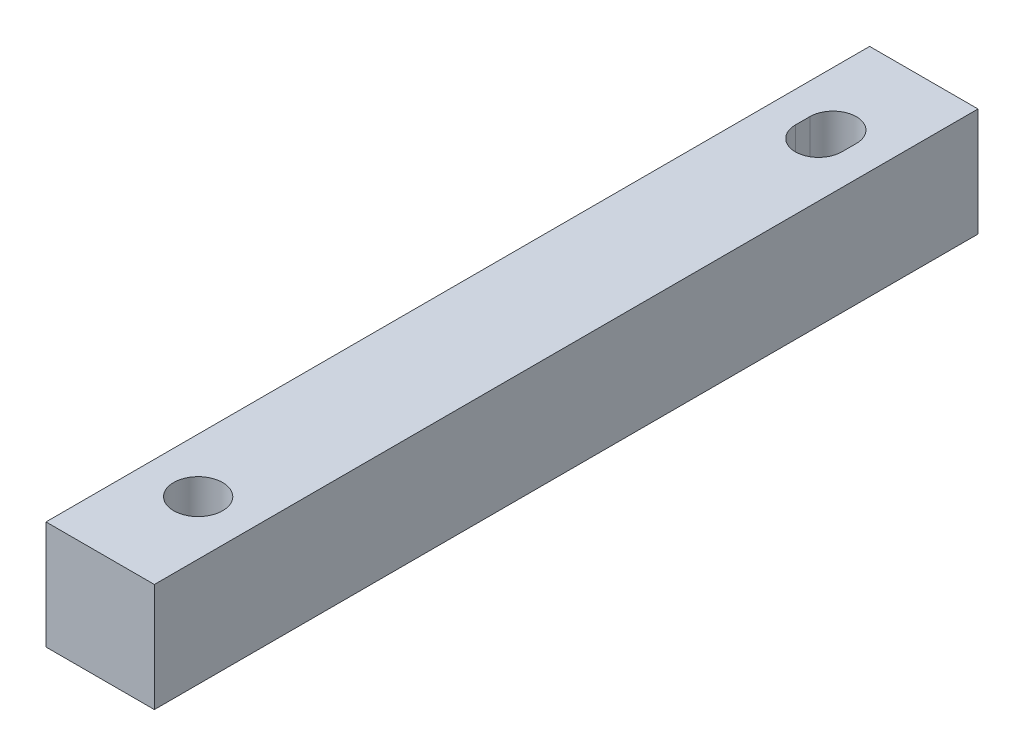
ISO-10303-21;
HEADER;
FILE_DESCRIPTION(('STEP AP214'),'2;1');
FILE_NAME('part.step','',(''),(''),'','','');
FILE_SCHEMA(('AUTOMOTIVE_DESIGN { 1 0 10303 214 1 1 1 1 }'));
ENDSEC;
DATA;
#1=APPLICATION_CONTEXT('core data for automotive mechanical design processes');
#2=APPLICATION_PROTOCOL_DEFINITION('international standard','automotive_design',2000,#1);
#3=PRODUCT_CONTEXT('',#1,'mechanical');
#4=PRODUCT('Part','Part','',(#3));
#5=PRODUCT_RELATED_PRODUCT_CATEGORY('part','',(#4));
#6=PRODUCT_DEFINITION_FORMATION('','',#4);
#7=PRODUCT_DEFINITION_CONTEXT('part definition',#1,'design');
#8=PRODUCT_DEFINITION('design','',#6,#7);
#9=PRODUCT_DEFINITION_SHAPE('','',#8);
#10=(LENGTH_UNIT() NAMED_UNIT(*) SI_UNIT(.MILLI.,.METRE.));
#11=(NAMED_UNIT(*) PLANE_ANGLE_UNIT() SI_UNIT($,.RADIAN.));
#12=(NAMED_UNIT(*) SI_UNIT($,.STERADIAN.) SOLID_ANGLE_UNIT());
#13=UNCERTAINTY_MEASURE_WITH_UNIT(LENGTH_MEASURE(1.E-05),#10,'distance_accuracy_value','');
#14=(GEOMETRIC_REPRESENTATION_CONTEXT(3) GLOBAL_UNCERTAINTY_ASSIGNED_CONTEXT((#13)) GLOBAL_UNIT_ASSIGNED_CONTEXT((#10,
#11,#12)) REPRESENTATION_CONTEXT('',''));
#15=CARTESIAN_POINT('',(0.,0.,0.));
#16=DIRECTION('',(0.,0.,1.));
#17=DIRECTION('',(1.,0.,0.));
#18=AXIS2_PLACEMENT_3D('',#15,#16,#17);
#19=CARTESIAN_POINT('',(-25.7385806955994,9.525,52.5567564118521));
#20=DIRECTION('',(1.,0.,0.));
#21=DIRECTION('',(0.,0.,-1.));
#22=AXIS2_PLACEMENT_3D('',#19,#20,#21);
#23=PLANE('',#22);
#24=DIRECTION('',(0.,0.,1.));
#25=VECTOR('',#24,1.);
#26=CARTESIAN_POINT('',(-25.7385806955994,0.,52.5567564118521));
#27=LINE('',#26,#25);
#28=CARTESIAN_POINT('',(-25.7385806955994,0.,-19.8332435881479));
#29=VERTEX_POINT('',#28);
#30=CARTESIAN_POINT('',(-25.7385806955994,0.,52.5567564118521));
#31=VERTEX_POINT('',#30);
#32=EDGE_CURVE('E144',#29,#31,#27,.T.);
#33=ORIENTED_EDGE('',*,*,#32,.T.);
#34=DIRECTION('',(0.,-1.,0.));
#35=VECTOR('',#34,1.);
#36=CARTESIAN_POINT('',(-25.7385806955994,9.525,52.5567564118521));
#37=LINE('',#36,#35);
#38=CARTESIAN_POINT('',(-25.7385806955994,9.525,52.5567564118521));
#39=VERTEX_POINT('',#38);
#40=EDGE_CURVE('E11',#39,#31,#37,.T.);
#41=ORIENTED_EDGE('',*,*,#40,.F.);
#42=DIRECTION('',(0.,0.,1.));
#43=VECTOR('',#42,1.);
#44=CARTESIAN_POINT('',(-25.7385806955994,9.525,52.5567564118521));
#45=LINE('',#44,#43);
#46=CARTESIAN_POINT('',(-25.7385806955994,9.525,-19.8332435881479));
#47=VERTEX_POINT('',#46);
#48=EDGE_CURVE('E133',#47,#39,#45,.T.);
#49=ORIENTED_EDGE('',*,*,#48,.F.);
#50=DIRECTION('',(0.,-1.,0.));
#51=VECTOR('',#50,1.);
#52=CARTESIAN_POINT('',(-25.7385806955994,9.525,-19.8332435881479));
#53=LINE('',#52,#51);
#54=EDGE_CURVE('E143',#47,#29,#53,.T.);
#55=ORIENTED_EDGE('',*,*,#54,.T.);
#56=EDGE_LOOP('',(#33,#41,#49,#55));
#57=FACE_BOUND('',#56,.T.);
#58=ADVANCED_FACE('F31',(#57),#23,.F.);
#59=CARTESIAN_POINT('',(-25.7385806955994,9.525,52.5567564118521));
#60=DIRECTION('',(0.,0.,-1.));
#61=DIRECTION('',(-1.,0.,0.));
#62=AXIS2_PLACEMENT_3D('',#59,#60,#61);
#63=PLANE('',#62);
#64=DIRECTION('',(1.,0.,0.));
#65=VECTOR('',#64,1.);
#66=CARTESIAN_POINT('',(-25.7385806955994,0.,52.5567564118521));
#67=LINE('',#66,#65);
#68=CARTESIAN_POINT('',(-16.2135806955994,0.,52.5567564118521));
#69=VERTEX_POINT('',#68);
#70=EDGE_CURVE('E147',#31,#69,#67,.T.);
#71=ORIENTED_EDGE('',*,*,#70,.T.);
#72=DIRECTION('',(0.,-1.,0.));
#73=VECTOR('',#72,1.);
#74=CARTESIAN_POINT('',(-16.2135806955994,9.525,52.5567564118521));
#75=LINE('',#74,#73);
#76=CARTESIAN_POINT('',(-16.2135806955994,9.525,52.5567564118521));
#77=VERTEX_POINT('',#76);
#78=EDGE_CURVE('E39',#77,#69,#75,.T.);
#79=ORIENTED_EDGE('',*,*,#78,.F.);
#80=DIRECTION('',(1.,0.,0.));
#81=VECTOR('',#80,1.);
#82=CARTESIAN_POINT('',(-25.7385806955994,9.525,52.5567564118521));
#83=LINE('',#82,#81);
#84=EDGE_CURVE('E136',#39,#77,#83,.T.);
#85=ORIENTED_EDGE('',*,*,#84,.F.);
#86=ORIENTED_EDGE('',*,*,#40,.T.);
#87=EDGE_LOOP('',(#71,#79,#85,#86));
#88=FACE_BOUND('',#87,.T.);
#89=ADVANCED_FACE('F177',(#88),#63,.F.);
#90=CARTESIAN_POINT('',(-16.2135806955994,9.525,52.5567564118521));
#91=DIRECTION('',(-1.,0.,0.));
#92=DIRECTION('',(0.,0.,1.));
#93=AXIS2_PLACEMENT_3D('',#90,#91,#92);
#94=PLANE('',#93);
#95=DIRECTION('',(0.,0.,-1.));
#96=VECTOR('',#95,1.);
#97=CARTESIAN_POINT('',(-16.2135806955994,0.,52.5567564118521));
#98=LINE('',#97,#96);
#99=CARTESIAN_POINT('',(-16.2135806955994,0.,-19.8332435881479));
#100=VERTEX_POINT('',#99);
#101=EDGE_CURVE('E149',#69,#100,#98,.T.);
#102=ORIENTED_EDGE('',*,*,#101,.T.);
#103=DIRECTION('',(0.,-1.,0.));
#104=VECTOR('',#103,1.);
#105=CARTESIAN_POINT('',(-16.2135806955994,9.525,-19.8332435881479));
#106=LINE('',#105,#104);
#107=CARTESIAN_POINT('',(-16.2135806955994,9.525,-19.8332435881479));
#108=VERTEX_POINT('',#107);
#109=EDGE_CURVE('E154',#108,#100,#106,.T.);
#110=ORIENTED_EDGE('',*,*,#109,.F.);
#111=DIRECTION('',(0.,0.,-1.));
#112=VECTOR('',#111,1.);
#113=CARTESIAN_POINT('',(-16.2135806955994,9.525,52.5567564118521));
#114=LINE('',#113,#112);
#115=EDGE_CURVE('E139',#77,#108,#114,.T.);
#116=ORIENTED_EDGE('',*,*,#115,.F.);
#117=ORIENTED_EDGE('',*,*,#78,.T.);
#118=EDGE_LOOP('',(#102,#110,#116,#117));
#119=FACE_BOUND('',#118,.T.);
#120=ADVANCED_FACE('F162',(#119),#94,.F.);
#121=CARTESIAN_POINT('',(-25.7385806955994,9.525,-19.8332435881479));
#122=DIRECTION('',(0.,0.,1.));
#123=DIRECTION('',(1.,0.,0.));
#124=AXIS2_PLACEMENT_3D('',#121,#122,#123);
#125=PLANE('',#124);
#126=DIRECTION('',(-1.,0.,0.));
#127=VECTOR('',#126,1.);
#128=CARTESIAN_POINT('',(-25.7385806955994,0.,-19.8332435881479));
#129=LINE('',#128,#127);
#130=EDGE_CURVE('E137',#100,#29,#129,.T.);
#131=ORIENTED_EDGE('',*,*,#130,.T.);
#132=ORIENTED_EDGE('',*,*,#54,.F.);
#133=DIRECTION('',(-1.,0.,0.));
#134=VECTOR('',#133,1.);
#135=CARTESIAN_POINT('',(-25.7385806955994,9.525,-19.8332435881479));
#136=LINE('',#135,#134);
#137=EDGE_CURVE('E141',#108,#47,#136,.T.);
#138=ORIENTED_EDGE('',*,*,#137,.F.);
#139=ORIENTED_EDGE('',*,*,#109,.T.);
#140=EDGE_LOOP('',(#131,#132,#138,#139));
#141=FACE_BOUND('',#140,.T.);
#142=ADVANCED_FACE('F170',(#141),#125,.F.);
#143=CARTESIAN_POINT('',(-25.7385806955994,9.525,-19.8332435881479));
#144=DIRECTION('',(0.,-1.,0.));
#145=DIRECTION('',(0.,0.,-1.));
#146=AXIS2_PLACEMENT_3D('',#143,#144,#145);
#147=PLANE('',#146);
#148=DIRECTION('',(0.,0.,1.));
#149=VECTOR('',#148,1.);
#150=CARTESIAN_POINT('',(-23.0214832911406,9.525,-11.8560560881479));
#151=LINE('',#150,#149);
#152=CARTESIAN_POINT('',(-23.0214832911406,9.525,-11.8560560881479));
#153=VERTEX_POINT('',#152);
#154=CARTESIAN_POINT('',(-23.0214832911406,9.525,-10.5860560881479));
#155=VERTEX_POINT('',#154);
#156=EDGE_CURVE('E115',#153,#155,#151,.T.);
#157=ORIENTED_EDGE('',*,*,#156,.F.);
#158=CARTESIAN_POINT('',(-20.9760806955994,9.525,-11.8560560881479));
#159=DIRECTION('',(0.,1.,0.));
#160=DIRECTION('',(0.,0.,1.));
#161=AXIS2_PLACEMENT_3D('',#158,#159,#160);
#162=CIRCLE('',#161,2.04540259554119);
#163=CARTESIAN_POINT('',(-18.9306781000582,9.525,-11.8560560881479));
#164=VERTEX_POINT('',#163);
#165=EDGE_CURVE('E46',#164,#153,#162,.T.);
#166=ORIENTED_EDGE('',*,*,#165,.F.);
#167=DIRECTION('',(0.,0.,-1.));
#168=VECTOR('',#167,1.);
#169=CARTESIAN_POINT('',(-18.9306781000582,9.525,-11.8560560881479));
#170=LINE('',#169,#168);
#171=CARTESIAN_POINT('',(-18.9306781000582,9.525,-10.5860560881479));
#172=VERTEX_POINT('',#171);
#173=EDGE_CURVE('E108',#172,#164,#170,.T.);
#174=ORIENTED_EDGE('',*,*,#173,.F.);
#175=CARTESIAN_POINT('',(-20.9760806955994,9.525,-10.5860560881479));
#176=DIRECTION('',(0.,1.,0.));
#177=DIRECTION('',(0.,0.,1.));
#178=AXIS2_PLACEMENT_3D('',#175,#176,#177);
#179=CIRCLE('',#178,2.04540259554119);
#180=EDGE_CURVE('E122',#155,#172,#179,.T.);
#181=ORIENTED_EDGE('',*,*,#180,.F.);
#182=EDGE_LOOP('',(#157,#166,#174,#181));
#183=FACE_BOUND('',#182,.T.);
#184=CARTESIAN_POINT('',(-20.9760806955994,9.525,43.9445689118521));
#185=DIRECTION('',(0.,1.,0.));
#186=DIRECTION('',(0.,0.,1.));
#187=AXIS2_PLACEMENT_3D('',#184,#185,#186);
#188=CIRCLE('',#187,2.15264999999999);
#189=CARTESIAN_POINT('',(-20.9760806955994,9.525,46.097218911852));
#190=VERTEX_POINT('',#189);
#191=EDGE_CURVE('E102',#190,#190,#188,.T.);
#192=ORIENTED_EDGE('',*,*,#191,.F.);
#193=EDGE_LOOP('',(#192));
#194=FACE_BOUND('',#193,.T.);
#195=ORIENTED_EDGE('',*,*,#48,.T.);
#196=ORIENTED_EDGE('',*,*,#84,.T.);
#197=ORIENTED_EDGE('',*,*,#115,.T.);
#198=ORIENTED_EDGE('',*,*,#137,.T.);
#199=EDGE_LOOP('',(#195,#196,#197,#198));
#200=FACE_BOUND('',#199,.T.);
#201=ADVANCED_FACE('F176',(#183,#194,#200),#147,.F.);
#202=CARTESIAN_POINT('',(-25.7385806955994,0.,-19.8332435881479));
#203=DIRECTION('',(0.,-1.,0.));
#204=DIRECTION('',(0.,0.,-1.));
#205=AXIS2_PLACEMENT_3D('',#202,#203,#204);
#206=PLANE('',#205);
#207=CARTESIAN_POINT('',(-20.9760806955994,0.,-11.8560560881479));
#208=DIRECTION('',(0.,-1.,0.));
#209=DIRECTION('',(0.,0.,-1.));
#210=AXIS2_PLACEMENT_3D('',#207,#208,#209);
#211=CIRCLE('',#210,2.04540259554119);
#212=CARTESIAN_POINT('',(-18.9306781000582,0.,-11.8560560881479));
#213=VERTEX_POINT('',#212);
#214=CARTESIAN_POINT('',(-23.0214832911406,0.,-11.8560560881479));
#215=VERTEX_POINT('',#214);
#216=EDGE_CURVE('E106',#213,#215,#211,.F.);
#217=ORIENTED_EDGE('',*,*,#216,.T.);
#218=DIRECTION('',(0.,0.,1.));
#219=VECTOR('',#218,1.);
#220=CARTESIAN_POINT('',(-23.0214832911406,0.,-11.8560560881479));
#221=LINE('',#220,#219);
#222=CARTESIAN_POINT('',(-23.0214832911406,0.,-10.5860560881479));
#223=VERTEX_POINT('',#222);
#224=EDGE_CURVE('E95',#215,#223,#221,.T.);
#225=ORIENTED_EDGE('',*,*,#224,.T.);
#226=CARTESIAN_POINT('',(-20.9760806955994,0.,-10.5860560881479));
#227=DIRECTION('',(0.,-1.,0.));
#228=DIRECTION('',(0.,0.,-1.));
#229=AXIS2_PLACEMENT_3D('',#226,#227,#228);
#230=CIRCLE('',#229,2.04540259554119);
#231=CARTESIAN_POINT('',(-18.9306781000582,0.,-10.5860560881479));
#232=VERTEX_POINT('',#231);
#233=EDGE_CURVE('E117',#223,#232,#230,.F.);
#234=ORIENTED_EDGE('',*,*,#233,.T.);
#235=DIRECTION('',(0.,0.,-1.));
#236=VECTOR('',#235,1.);
#237=CARTESIAN_POINT('',(-18.9306781000582,0.,-11.8560560881479));
#238=LINE('',#237,#236);
#239=EDGE_CURVE('E113',#232,#213,#238,.T.);
#240=ORIENTED_EDGE('',*,*,#239,.T.);
#241=EDGE_LOOP('',(#217,#225,#234,#240));
#242=FACE_BOUND('',#241,.T.);
#243=CARTESIAN_POINT('',(-20.9760806955994,0.,43.9445689118521));
#244=DIRECTION('',(0.,-1.,0.));
#245=DIRECTION('',(0.,0.,-1.));
#246=AXIS2_PLACEMENT_3D('',#243,#244,#245);
#247=CIRCLE('',#246,2.15264999999999);
#248=CARTESIAN_POINT('',(-20.9760806955994,0.,41.7919189118521));
#249=VERTEX_POINT('',#248);
#250=EDGE_CURVE('E34',#249,#249,#247,.T.);
#251=ORIENTED_EDGE('',*,*,#250,.F.);
#252=EDGE_LOOP('',(#251));
#253=FACE_BOUND('',#252,.T.);
#254=ORIENTED_EDGE('',*,*,#32,.F.);
#255=ORIENTED_EDGE('',*,*,#130,.F.);
#256=ORIENTED_EDGE('',*,*,#101,.F.);
#257=ORIENTED_EDGE('',*,*,#70,.F.);
#258=EDGE_LOOP('',(#254,#255,#256,#257));
#259=FACE_BOUND('',#258,.T.);
#260=ADVANCED_FACE('F111',(#242,#253,#259),#206,.T.);
#261=CARTESIAN_POINT('',(-20.9760806955994,9.525,43.9445689118521));
#262=DIRECTION('',(0.,1.,0.));
#263=DIRECTION('',(0.,0.,1.));
#264=AXIS2_PLACEMENT_3D('',#261,#262,#263);
#265=CYLINDRICAL_SURFACE('',#264,2.15264999999999);
#266=ORIENTED_EDGE('',*,*,#250,.T.);
#267=EDGE_LOOP('',(#266));
#268=FACE_BOUND('',#267,.T.);
#269=ORIENTED_EDGE('',*,*,#191,.T.);
#270=EDGE_LOOP('',(#269));
#271=FACE_BOUND('',#270,.T.);
#272=ADVANCED_FACE('F189',(#268,#271),#265,.F.);
#273=CARTESIAN_POINT('',(-20.9760806955994,-0.000999999999999265,-11.8560560881479));
#274=DIRECTION('',(0.,1.,0.));
#275=DIRECTION('',(0.,0.,1.));
#276=AXIS2_PLACEMENT_3D('',#273,#274,#275);
#277=CYLINDRICAL_SURFACE('',#276,2.04540259554119);
#278=DIRECTION('',(0.,1.,0.));
#279=VECTOR('',#278,1.);
#280=CARTESIAN_POINT('',(-18.9306781000582,-0.000999999999999265,-11.8560560881479));
#281=LINE('',#280,#279);
#282=EDGE_CURVE('E103',#213,#164,#281,.T.);
#283=ORIENTED_EDGE('',*,*,#282,.T.);
#284=ORIENTED_EDGE('',*,*,#165,.T.);
#285=DIRECTION('',(0.,1.,0.));
#286=VECTOR('',#285,1.);
#287=CARTESIAN_POINT('',(-23.0214832911406,-0.000999999999999265,-11.8560560881479));
#288=LINE('',#287,#286);
#289=EDGE_CURVE('E97',#215,#153,#288,.T.);
#290=ORIENTED_EDGE('',*,*,#289,.F.);
#291=ORIENTED_EDGE('',*,*,#216,.F.);
#292=EDGE_LOOP('',(#283,#284,#290,#291));
#293=FACE_BOUND('',#292,.T.);
#294=ADVANCED_FACE('F105',(#293),#277,.F.);
#295=CARTESIAN_POINT('',(-18.9306781000582,-0.000999999999999265,-11.8560560881479));
#296=DIRECTION('',(1.,0.,0.));
#297=DIRECTION('',(0.,0.,-1.));
#298=AXIS2_PLACEMENT_3D('',#295,#296,#297);
#299=PLANE('',#298);
#300=DIRECTION('',(0.,1.,0.));
#301=VECTOR('',#300,1.);
#302=CARTESIAN_POINT('',(-18.9306781000582,-0.000999999999999265,-10.5860560881479));
#303=LINE('',#302,#301);
#304=EDGE_CURVE('E128',#232,#172,#303,.T.);
#305=ORIENTED_EDGE('',*,*,#304,.T.);
#306=ORIENTED_EDGE('',*,*,#173,.T.);
#307=ORIENTED_EDGE('',*,*,#282,.F.);
#308=ORIENTED_EDGE('',*,*,#239,.F.);
#309=EDGE_LOOP('',(#305,#306,#307,#308));
#310=FACE_BOUND('',#309,.T.);
#311=ADVANCED_FACE('F198',(#310),#299,.F.);
#312=CARTESIAN_POINT('',(-20.9760806955994,-0.000999999999999265,-10.5860560881479));
#313=DIRECTION('',(0.,1.,0.));
#314=DIRECTION('',(0.,0.,1.));
#315=AXIS2_PLACEMENT_3D('',#312,#313,#314);
#316=CYLINDRICAL_SURFACE('',#315,2.04540259554119);
#317=DIRECTION('',(0.,1.,0.));
#318=VECTOR('',#317,1.);
#319=CARTESIAN_POINT('',(-23.0214832911406,-0.000999999999999265,-10.5860560881479));
#320=LINE('',#319,#318);
#321=EDGE_CURVE('E54',#223,#155,#320,.T.);
#322=ORIENTED_EDGE('',*,*,#321,.T.);
#323=ORIENTED_EDGE('',*,*,#180,.T.);
#324=ORIENTED_EDGE('',*,*,#304,.F.);
#325=ORIENTED_EDGE('',*,*,#233,.F.);
#326=EDGE_LOOP('',(#322,#323,#324,#325));
#327=FACE_BOUND('',#326,.T.);
#328=ADVANCED_FACE('F201',(#327),#316,.F.);
#329=CARTESIAN_POINT('',(-23.0214832911406,-0.000999999999999265,-11.8560560881479));
#330=DIRECTION('',(-1.,0.,0.));
#331=DIRECTION('',(0.,0.,1.));
#332=AXIS2_PLACEMENT_3D('',#329,#330,#331);
#333=PLANE('',#332);
#334=ORIENTED_EDGE('',*,*,#289,.T.);
#335=ORIENTED_EDGE('',*,*,#156,.T.);
#336=ORIENTED_EDGE('',*,*,#321,.F.);
#337=ORIENTED_EDGE('',*,*,#224,.F.);
#338=EDGE_LOOP('',(#334,#335,#336,#337));
#339=FACE_BOUND('',#338,.T.);
#340=ADVANCED_FACE('F96',(#339),#333,.F.);
#341=CLOSED_SHELL('',(#58,#89,#120,#142,#201,#260,#272,#294,#311,#328,#340));
#342=MANIFOLD_SOLID_BREP('B2',#341);
#343=ADVANCED_BREP_SHAPE_REPRESENTATION('',(#18,#342),#14);
#344=SHAPE_DEFINITION_REPRESENTATION(#9,#343);
ENDSEC;
END-ISO-10303-21;
